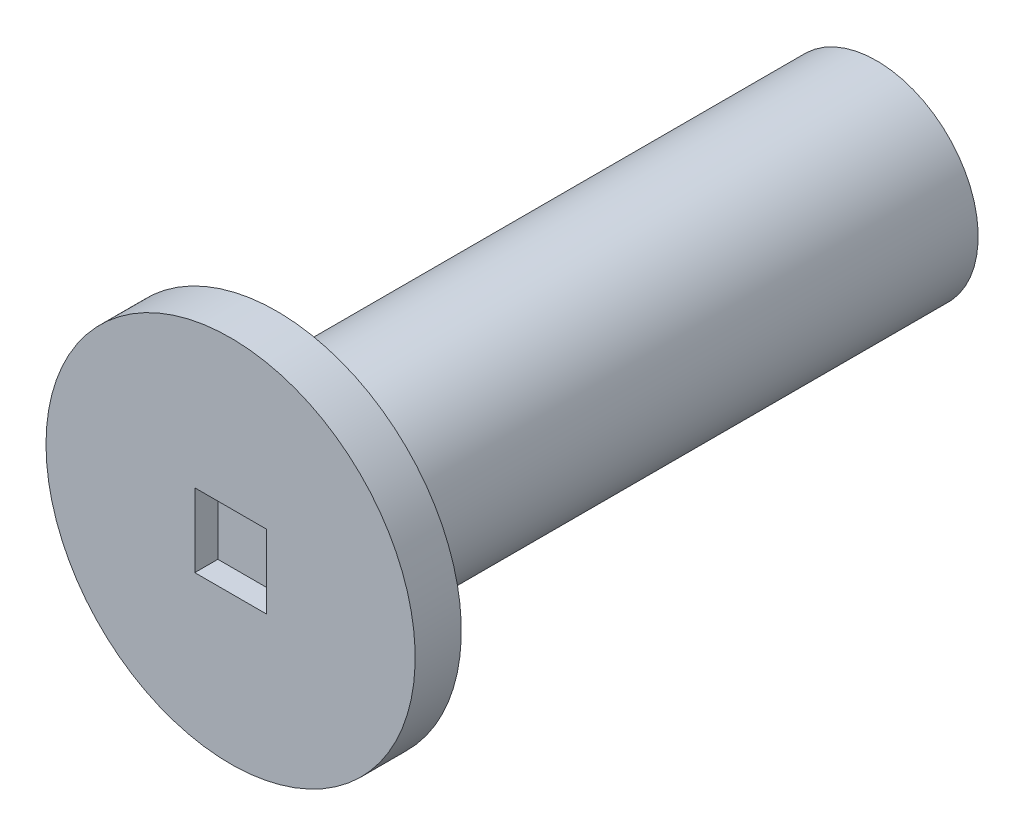
ISO-10303-21;
HEADER;
FILE_DESCRIPTION(('STEP AP214'),'2;1');
FILE_NAME('part.step','',(''),(''),'','','');
FILE_SCHEMA(('AUTOMOTIVE_DESIGN { 1 0 10303 214 1 1 1 1 }'));
ENDSEC;
DATA;
#1=APPLICATION_CONTEXT('core data for automotive mechanical design processes');
#2=APPLICATION_PROTOCOL_DEFINITION('international standard','automotive_design',2000,#1);
#3=PRODUCT_CONTEXT('',#1,'mechanical');
#4=PRODUCT('Part','Part','',(#3));
#5=PRODUCT_RELATED_PRODUCT_CATEGORY('part','',(#4));
#6=PRODUCT_DEFINITION_FORMATION('','',#4);
#7=PRODUCT_DEFINITION_CONTEXT('part definition',#1,'design');
#8=PRODUCT_DEFINITION('design','',#6,#7);
#9=PRODUCT_DEFINITION_SHAPE('','',#8);
#10=(LENGTH_UNIT() NAMED_UNIT(*) SI_UNIT(.MILLI.,.METRE.));
#11=(NAMED_UNIT(*) PLANE_ANGLE_UNIT() SI_UNIT($,.RADIAN.));
#12=(NAMED_UNIT(*) SI_UNIT($,.STERADIAN.) SOLID_ANGLE_UNIT());
#13=UNCERTAINTY_MEASURE_WITH_UNIT(LENGTH_MEASURE(1.E-05),#10,'distance_accuracy_value','');
#14=(GEOMETRIC_REPRESENTATION_CONTEXT(3) GLOBAL_UNCERTAINTY_ASSIGNED_CONTEXT((#13)) GLOBAL_UNIT_ASSIGNED_CONTEXT((#10,
#11,#12)) REPRESENTATION_CONTEXT('',''));
#15=CARTESIAN_POINT('',(0.,0.,0.));
#16=DIRECTION('',(0.,0.,1.));
#17=DIRECTION('',(1.,0.,0.));
#18=AXIS2_PLACEMENT_3D('',#15,#16,#17);
#19=CARTESIAN_POINT('',(0.,0.,0.));
#20=DIRECTION('',(0.,0.,1.));
#21=DIRECTION('',(1.,0.,0.));
#22=AXIS2_PLACEMENT_3D('',#19,#20,#21);
#23=PLANE('',#22);
#24=CARTESIAN_POINT('',(0.,0.,0.));
#25=DIRECTION('',(0.,0.,1.));
#26=DIRECTION('',(1.,0.,0.));
#27=AXIS2_PLACEMENT_3D('',#24,#25,#26);
#28=CIRCLE('',#27,2.2);
#29=CARTESIAN_POINT('',(-2.2,0.,0.));
#30=VERTEX_POINT('',#29);
#31=EDGE_CURVE('E103',#30,#30,#28,.T.);
#32=ORIENTED_EDGE('',*,*,#31,.T.);
#33=EDGE_LOOP('',(#32));
#34=FACE_BOUND('',#33,.T.);
#35=CARTESIAN_POINT('',(0.,0.,0.));
#36=DIRECTION('',(0.,0.,1.));
#37=DIRECTION('',(1.,0.,0.));
#38=AXIS2_PLACEMENT_3D('',#35,#36,#37);
#39=CIRCLE('',#38,4.);
#40=CARTESIAN_POINT('',(-4.,0.,0.));
#41=VERTEX_POINT('',#40);
#42=EDGE_CURVE('E11',#41,#41,#39,.T.);
#43=ORIENTED_EDGE('',*,*,#42,.F.);
#44=EDGE_LOOP('',(#43));
#45=FACE_BOUND('',#44,.T.);
#46=ADVANCED_FACE('F16',(#34,#45),#23,.F.);
#47=CARTESIAN_POINT('',(0.,0.,1.));
#48=DIRECTION('',(0.,0.,1.));
#49=DIRECTION('',(1.,0.,0.));
#50=AXIS2_PLACEMENT_3D('',#47,#48,#49);
#51=PLANE('',#50);
#52=DIRECTION('',(0.,1.,0.));
#53=VECTOR('',#52,1.);
#54=CARTESIAN_POINT('',(-0.775906475947883,-0.398152632129984,1.));
#55=LINE('',#54,#53);
#56=CARTESIAN_POINT('',(-0.775906475947883,-0.796305264259968,1.));
#57=VERTEX_POINT('',#56);
#58=CARTESIAN_POINT('',(-0.775906475947883,0.796305264259968,1.));
#59=VERTEX_POINT('',#58);
#60=EDGE_CURVE('E109',#57,#59,#55,.T.);
#61=ORIENTED_EDGE('',*,*,#60,.T.);
#62=DIRECTION('',(1.,0.,0.));
#63=VECTOR('',#62,1.);
#64=CARTESIAN_POINT('',(-0.387953237973941,0.796305264259968,1.));
#65=LINE('',#64,#63);
#66=CARTESIAN_POINT('',(0.775906475947883,0.796305264259968,1.));
#67=VERTEX_POINT('',#66);
#68=EDGE_CURVE('E122',#59,#67,#65,.T.);
#69=ORIENTED_EDGE('',*,*,#68,.T.);
#70=DIRECTION('',(0.,-1.,0.));
#71=VECTOR('',#70,1.);
#72=CARTESIAN_POINT('',(0.775906475947883,0.398152632129984,1.));
#73=LINE('',#72,#71);
#74=CARTESIAN_POINT('',(0.775906475947883,-0.796305264259968,1.));
#75=VERTEX_POINT('',#74);
#76=EDGE_CURVE('E143',#67,#75,#73,.T.);
#77=ORIENTED_EDGE('',*,*,#76,.T.);
#78=DIRECTION('',(-1.,0.,0.));
#79=VECTOR('',#78,1.);
#80=CARTESIAN_POINT('',(0.387953237973941,-0.796305264259968,1.));
#81=LINE('',#80,#79);
#82=EDGE_CURVE('E90',#75,#57,#81,.T.);
#83=ORIENTED_EDGE('',*,*,#82,.T.);
#84=EDGE_LOOP('',(#61,#69,#77,#83));
#85=FACE_BOUND('',#84,.T.);
#86=CARTESIAN_POINT('',(0.,0.,1.));
#87=DIRECTION('',(0.,0.,1.));
#88=DIRECTION('',(1.,0.,0.));
#89=AXIS2_PLACEMENT_3D('',#86,#87,#88);
#90=CIRCLE('',#89,4.);
#91=CARTESIAN_POINT('',(-4.,0.,1.));
#92=VERTEX_POINT('',#91);
#93=EDGE_CURVE('E139',#92,#92,#90,.T.);
#94=ORIENTED_EDGE('',*,*,#93,.T.);
#95=EDGE_LOOP('',(#94));
#96=FACE_BOUND('',#95,.T.);
#97=ADVANCED_FACE('F174',(#85,#96),#51,.T.);
#98=CARTESIAN_POINT('',(0.,0.,0.));
#99=DIRECTION('',(0.,0.,1.));
#100=DIRECTION('',(1.,0.,0.));
#101=AXIS2_PLACEMENT_3D('',#98,#99,#100);
#102=CYLINDRICAL_SURFACE('',#101,4.);
#103=ORIENTED_EDGE('',*,*,#93,.F.);
#104=DIRECTION('',(0.,0.,-1.));
#105=VECTOR('',#104,1.);
#106=CARTESIAN_POINT('',(-4.,0.,0.));
#107=LINE('',#106,#105);
#108=EDGE_CURVE('E26',#92,#41,#107,.T.);
#109=ORIENTED_EDGE('',*,*,#108,.T.);
#110=ORIENTED_EDGE('',*,*,#42,.T.);
#111=ORIENTED_EDGE('',*,*,#108,.F.);
#112=EDGE_LOOP('',(#103,#109,#110,#111));
#113=FACE_BOUND('',#112,.T.);
#114=ADVANCED_FACE('F18',(#113),#102,.T.);
#115=CARTESIAN_POINT('',(0.,0.,0.));
#116=DIRECTION('',(0.,0.,-1.));
#117=DIRECTION('',(1.,0.,0.));
#118=AXIS2_PLACEMENT_3D('',#115,#116,#117);
#119=CYLINDRICAL_SURFACE('',#118,2.2);
#120=CARTESIAN_POINT('',(0.,0.,-13.));
#121=DIRECTION('',(0.,0.,-1.));
#122=DIRECTION('',(1.,0.,0.));
#123=AXIS2_PLACEMENT_3D('',#120,#121,#122);
#124=CIRCLE('',#123,2.2);
#125=CARTESIAN_POINT('',(-2.2,0.,-13.));
#126=VERTEX_POINT('',#125);
#127=EDGE_CURVE('E101',#126,#126,#124,.T.);
#128=ORIENTED_EDGE('',*,*,#127,.F.);
#129=DIRECTION('',(0.,0.,1.));
#130=VECTOR('',#129,1.);
#131=CARTESIAN_POINT('',(-2.2,0.,0.));
#132=LINE('',#131,#130);
#133=EDGE_CURVE('E98',#126,#30,#132,.T.);
#134=ORIENTED_EDGE('',*,*,#133,.T.);
#135=ORIENTED_EDGE('',*,*,#31,.F.);
#136=ORIENTED_EDGE('',*,*,#133,.F.);
#137=EDGE_LOOP('',(#128,#134,#135,#136));
#138=FACE_BOUND('',#137,.T.);
#139=ADVANCED_FACE('F100',(#138),#119,.T.);
#140=CARTESIAN_POINT('',(0.,0.,0.5));
#141=DIRECTION('',(0.,0.,-1.));
#142=DIRECTION('',(0.,-1.,0.));
#143=AXIS2_PLACEMENT_3D('',#140,#141,#142);
#144=PLANE('',#143);
#145=DIRECTION('',(1.,0.,0.));
#146=VECTOR('',#145,1.);
#147=CARTESIAN_POINT('',(-0.775906475947883,0.796305264259968,0.5));
#148=LINE('',#147,#146);
#149=CARTESIAN_POINT('',(-0.775906475947883,0.796305264259968,0.5));
#150=VERTEX_POINT('',#149);
#151=CARTESIAN_POINT('',(0.775906475947883,0.796305264259968,0.5));
#152=VERTEX_POINT('',#151);
#153=EDGE_CURVE('E58',#150,#152,#148,.T.);
#154=ORIENTED_EDGE('',*,*,#153,.F.);
#155=DIRECTION('',(0.,1.,0.));
#156=VECTOR('',#155,1.);
#157=CARTESIAN_POINT('',(-0.775906475947883,-0.796305264259968,0.5));
#158=LINE('',#157,#156);
#159=CARTESIAN_POINT('',(-0.775906475947883,-0.796305264259968,0.5));
#160=VERTEX_POINT('',#159);
#161=EDGE_CURVE('E134',#160,#150,#158,.T.);
#162=ORIENTED_EDGE('',*,*,#161,.F.);
#163=DIRECTION('',(-1.,0.,0.));
#164=VECTOR('',#163,1.);
#165=CARTESIAN_POINT('',(0.775906475947883,-0.796305264259968,0.5));
#166=LINE('',#165,#164);
#167=CARTESIAN_POINT('',(0.775906475947883,-0.796305264259968,0.5));
#168=VERTEX_POINT('',#167);
#169=EDGE_CURVE('E72',#168,#160,#166,.T.);
#170=ORIENTED_EDGE('',*,*,#169,.F.);
#171=DIRECTION('',(0.,-1.,0.));
#172=VECTOR('',#171,1.);
#173=CARTESIAN_POINT('',(0.775906475947883,0.796305264259968,0.5));
#174=LINE('',#173,#172);
#175=EDGE_CURVE('E120',#152,#168,#174,.T.);
#176=ORIENTED_EDGE('',*,*,#175,.F.);
#177=EDGE_LOOP('',(#154,#162,#170,#176));
#178=FACE_BOUND('',#177,.T.);
#179=ADVANCED_FACE('F167',(#178),#144,.F.);
#180=CARTESIAN_POINT('',(-0.775906475947883,0.796305264259968,1.));
#181=DIRECTION('',(0.,1.,0.));
#182=DIRECTION('',(1.,0.,0.));
#183=AXIS2_PLACEMENT_3D('',#180,#181,#182);
#184=PLANE('',#183);
#185=ORIENTED_EDGE('',*,*,#68,.F.);
#186=DIRECTION('',(0.,0.,-1.));
#187=VECTOR('',#186,1.);
#188=CARTESIAN_POINT('',(-0.775906475947883,0.796305264259968,1.));
#189=LINE('',#188,#187);
#190=EDGE_CURVE('E130',#59,#150,#189,.T.);
#191=ORIENTED_EDGE('',*,*,#190,.T.);
#192=ORIENTED_EDGE('',*,*,#153,.T.);
#193=DIRECTION('',(0.,0.,-1.));
#194=VECTOR('',#193,1.);
#195=CARTESIAN_POINT('',(0.775906475947883,0.796305264259968,1.));
#196=LINE('',#195,#194);
#197=EDGE_CURVE('E123',#67,#152,#196,.T.);
#198=ORIENTED_EDGE('',*,*,#197,.F.);
#199=EDGE_LOOP('',(#185,#191,#192,#198));
#200=FACE_BOUND('',#199,.T.);
#201=ADVANCED_FACE('F173',(#200),#184,.F.);
#202=CARTESIAN_POINT('',(0.775906475947883,0.796305264259968,1.));
#203=DIRECTION('',(1.,0.,0.));
#204=DIRECTION('',(0.,1.,0.));
#205=AXIS2_PLACEMENT_3D('',#202,#203,#204);
#206=PLANE('',#205);
#207=ORIENTED_EDGE('',*,*,#76,.F.);
#208=ORIENTED_EDGE('',*,*,#197,.T.);
#209=ORIENTED_EDGE('',*,*,#175,.T.);
#210=DIRECTION('',(0.,0.,-1.));
#211=VECTOR('',#210,1.);
#212=CARTESIAN_POINT('',(0.775906475947883,-0.796305264259968,1.));
#213=LINE('',#212,#211);
#214=EDGE_CURVE('E129',#75,#168,#213,.T.);
#215=ORIENTED_EDGE('',*,*,#214,.F.);
#216=EDGE_LOOP('',(#207,#208,#209,#215));
#217=FACE_BOUND('',#216,.T.);
#218=ADVANCED_FACE('F170',(#217),#206,.F.);
#219=CARTESIAN_POINT('',(0.775906475947883,-0.796305264259968,1.));
#220=DIRECTION('',(0.,-1.,0.));
#221=DIRECTION('',(0.,0.,-1.));
#222=AXIS2_PLACEMENT_3D('',#219,#220,#221);
#223=PLANE('',#222);
#224=ORIENTED_EDGE('',*,*,#82,.F.);
#225=ORIENTED_EDGE('',*,*,#214,.T.);
#226=ORIENTED_EDGE('',*,*,#169,.T.);
#227=DIRECTION('',(0.,0.,-1.));
#228=VECTOR('',#227,1.);
#229=CARTESIAN_POINT('',(-0.775906475947883,-0.796305264259968,1.));
#230=LINE('',#229,#228);
#231=EDGE_CURVE('E115',#57,#160,#230,.T.);
#232=ORIENTED_EDGE('',*,*,#231,.F.);
#233=EDGE_LOOP('',(#224,#225,#226,#232));
#234=FACE_BOUND('',#233,.T.);
#235=ADVANCED_FACE('F168',(#234),#223,.F.);
#236=CARTESIAN_POINT('',(-0.775906475947883,-0.796305264259968,1.));
#237=DIRECTION('',(-1.,0.,0.));
#238=DIRECTION('',(0.,0.,1.));
#239=AXIS2_PLACEMENT_3D('',#236,#237,#238);
#240=PLANE('',#239);
#241=ORIENTED_EDGE('',*,*,#60,.F.);
#242=ORIENTED_EDGE('',*,*,#231,.T.);
#243=ORIENTED_EDGE('',*,*,#161,.T.);
#244=ORIENTED_EDGE('',*,*,#190,.F.);
#245=EDGE_LOOP('',(#241,#242,#243,#244));
#246=FACE_BOUND('',#245,.T.);
#247=ADVANCED_FACE('F166',(#246),#240,.F.);
#248=CARTESIAN_POINT('',(0.,0.,-13.));
#249=DIRECTION('',(0.,0.,1.));
#250=DIRECTION('',(1.,0.,0.));
#251=AXIS2_PLACEMENT_3D('',#248,#249,#250);
#252=PLANE('',#251);
#253=ORIENTED_EDGE('',*,*,#127,.T.);
#254=EDGE_LOOP('',(#253));
#255=FACE_BOUND('',#254,.T.);
#256=ADVANCED_FACE('F107',(#255),#252,.F.);
#257=CLOSED_SHELL('',(#46,#97,#114,#139,#179,#201,#218,#235,#247,#256));
#258=MANIFOLD_SOLID_BREP('B1',#257);
#259=ADVANCED_BREP_SHAPE_REPRESENTATION('',(#18,#258),#14);
#260=SHAPE_DEFINITION_REPRESENTATION(#9,#259);
ENDSEC;
END-ISO-10303-21;
